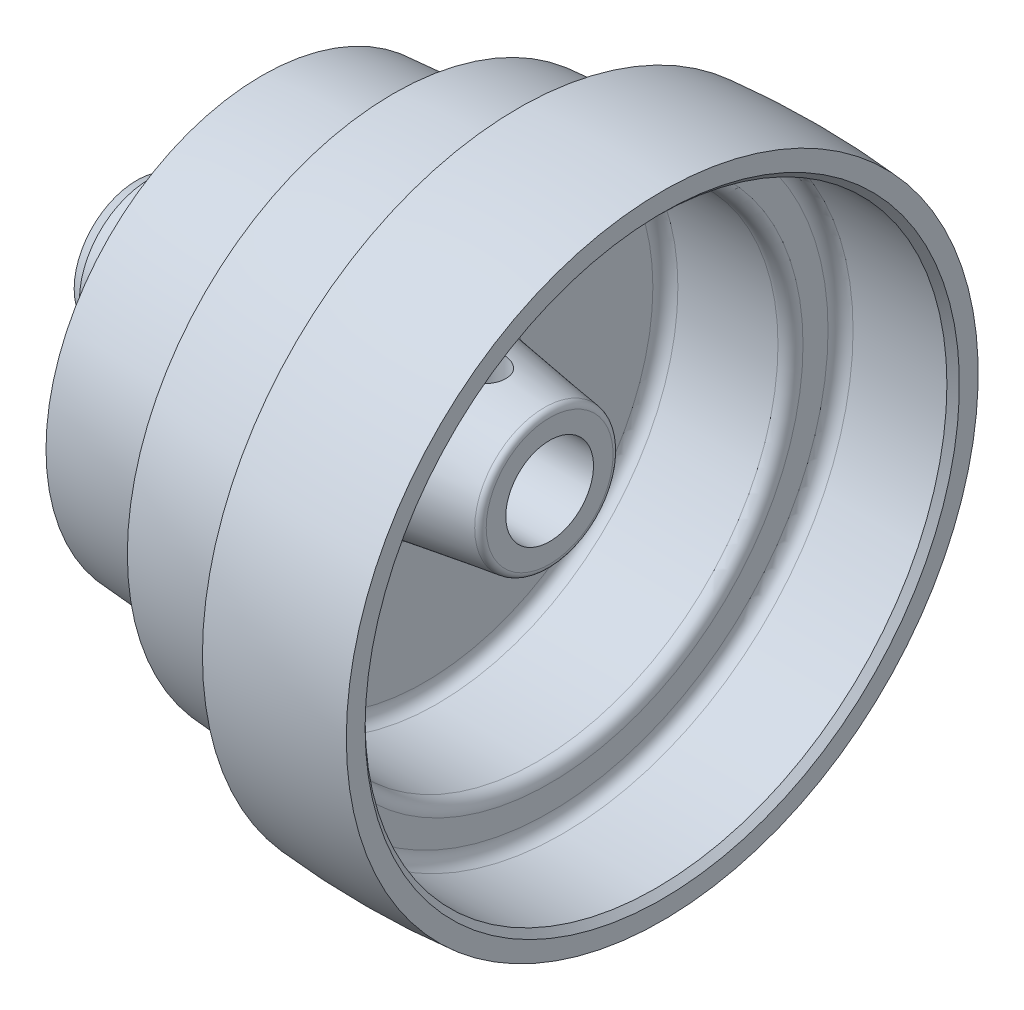
ISO-10303-21;
HEADER;
FILE_DESCRIPTION(('STEP AP214'),'2;1');
FILE_NAME('part.step','',(''),(''),'','','');
FILE_SCHEMA(('AUTOMOTIVE_DESIGN { 1 0 10303 214 1 1 1 1 }'));
ENDSEC;
DATA;
#1=APPLICATION_CONTEXT('core data for automotive mechanical design processes');
#2=APPLICATION_PROTOCOL_DEFINITION('international standard','automotive_design',2000,#1);
#3=PRODUCT_CONTEXT('',#1,'mechanical');
#4=PRODUCT('Part','Part','',(#3));
#5=PRODUCT_RELATED_PRODUCT_CATEGORY('part','',(#4));
#6=PRODUCT_DEFINITION_FORMATION('','',#4);
#7=PRODUCT_DEFINITION_CONTEXT('part definition',#1,'design');
#8=PRODUCT_DEFINITION('design','',#6,#7);
#9=PRODUCT_DEFINITION_SHAPE('','',#8);
#10=(LENGTH_UNIT() NAMED_UNIT(*) SI_UNIT(.MILLI.,.METRE.));
#11=(NAMED_UNIT(*) PLANE_ANGLE_UNIT() SI_UNIT($,.RADIAN.));
#12=(NAMED_UNIT(*) SI_UNIT($,.STERADIAN.) SOLID_ANGLE_UNIT());
#13=UNCERTAINTY_MEASURE_WITH_UNIT(LENGTH_MEASURE(1.E-05),#10,'distance_accuracy_value','');
#14=(GEOMETRIC_REPRESENTATION_CONTEXT(3) GLOBAL_UNCERTAINTY_ASSIGNED_CONTEXT((#13)) GLOBAL_UNIT_ASSIGNED_CONTEXT((#10,
#11,#12)) REPRESENTATION_CONTEXT('',''));
#15=CARTESIAN_POINT('',(0.,0.,0.));
#16=DIRECTION('',(0.,0.,1.));
#17=DIRECTION('',(1.,0.,0.));
#18=AXIS2_PLACEMENT_3D('',#15,#16,#17);
#19=CARTESIAN_POINT('',(0.,0.,0.));
#20=DIRECTION('',(-1.,0.,0.));
#21=DIRECTION('',(0.,0.,1.));
#22=AXIS2_PLACEMENT_3D('',#19,#20,#21);
#23=CYLINDRICAL_SURFACE('',#22,11.1252);
#24=CARTESIAN_POINT('',(104.775,0.,0.));
#25=DIRECTION('',(-1.,0.,0.));
#26=DIRECTION('',(0.,0.,1.));
#27=AXIS2_PLACEMENT_3D('',#24,#25,#26);
#28=CIRCLE('',#27,11.1252);
#29=CARTESIAN_POINT('',(104.775,0.,11.1252));
#30=VERTEX_POINT('',#29);
#31=EDGE_CURVE('E42',#30,#30,#28,.T.);
#32=ORIENTED_EDGE('',*,*,#31,.F.);
#33=EDGE_LOOP('',(#32));
#34=FACE_BOUND('',#33,.T.);
#35=CARTESIAN_POINT('',(0.,0.,0.));
#36=DIRECTION('',(-1.,0.,0.));
#37=DIRECTION('',(0.,0.,1.));
#38=AXIS2_PLACEMENT_3D('',#35,#36,#37);
#39=CIRCLE('',#38,11.1252);
#40=CARTESIAN_POINT('',(0.,0.,11.1252));
#41=VERTEX_POINT('',#40);
#42=EDGE_CURVE('E38',#41,#41,#39,.T.);
#43=ORIENTED_EDGE('',*,*,#42,.T.);
#44=EDGE_LOOP('',(#43));
#45=FACE_BOUND('',#44,.T.);
#46=CARTESIAN_POINT('',(88.9,10.0542860905188,-4.7625));
#47=CARTESIAN_POINT('',(88.7733011944272,10.0542871124357,-4.76249904606793));
#48=CARTESIAN_POINT('',(88.6465615300433,10.0566892733402,-4.75743676446919));
#49=CARTESIAN_POINT('',(88.3940105295757,10.0662182189194,-4.7372403874833));
#50=CARTESIAN_POINT('',(88.2681998283874,10.0733479780491,-4.72209995121747));
#51=CARTESIAN_POINT('',(88.0182481900197,10.092105518024,-4.68187715720568));
#52=CARTESIAN_POINT('',(87.8941112442076,10.1037425707971,-4.65677430318766));
#53=CARTESIAN_POINT('',(87.6486111749218,10.1311277582626,-4.59689107489739));
#54=CARTESIAN_POINT('',(87.5272492461105,10.146877628612,-4.56210661446522));
#55=CARTESIAN_POINT('',(87.2886948832533,10.1819015839587,-4.48339148983284));
#56=CARTESIAN_POINT('',(87.1714855660387,10.2011587967067,-4.43950447934892));
#57=CARTESIAN_POINT('',(86.9413105061965,10.2426702954767,-4.34287288732901));
#58=CARTESIAN_POINT('',(86.8283463835197,10.2649257110436,-4.29012496566914));
#59=CARTESIAN_POINT('',(86.496903826267,10.3352326746661,-4.11924844708133));
#60=CARTESIAN_POINT('',(86.2855844329065,10.386870103442,-3.98839031697297));
#61=CARTESIAN_POINT('',(85.8746855741986,10.4975997532583,-3.68750068601825));
#62=CARTESIAN_POINT('',(85.6765587151163,10.5569529350404,-3.51559783554345));
#63=CARTESIAN_POINT('',(85.3107659592518,10.6743263538246,-3.14120919298355));
#64=CARTESIAN_POINT('',(85.1431121935144,10.7323460519858,-2.93871127978598));
#65=CARTESIAN_POINT('',(84.914363081936,10.8152032797137,-2.61056620569943));
#66=CARTESIAN_POINT('',(84.8405466937211,10.8426836459681,-2.49425081074264));
#67=CARTESIAN_POINT('',(84.7030483773688,10.8949081597976,-2.25521259813972));
#68=CARTESIAN_POINT('',(84.6393622207912,10.9196534476934,-2.13249248243429));
#69=CARTESIAN_POINT('',(84.5226968780887,10.9657000605778,-1.88143352512228));
#70=CARTESIAN_POINT('',(84.4697185691238,10.987001103394,-1.75309422425296));
#71=CARTESIAN_POINT('',(84.3750396700995,11.0255187468169,-1.49178944345422));
#72=CARTESIAN_POINT('',(84.3333333666217,11.0427374161027,-1.35882634589975));
#73=CARTESIAN_POINT('',(84.263586321592,11.0717682114978,-1.09657475667202));
#74=CARTESIAN_POINT('',(84.2349278387432,11.0838226297055,-0.967477213218868));
#75=CARTESIAN_POINT('',(84.1884245020425,11.1034754592065,-0.707068600058978));
#76=CARTESIAN_POINT('',(84.1705747746665,11.1110758786985,-0.575758555430948));
#77=CARTESIAN_POINT('',(84.1458808575754,11.1216092704234,-0.31194140844064));
#78=CARTESIAN_POINT('',(84.1390349512154,11.1245429706843,-0.179434496039181));
#79=CARTESIAN_POINT('',(84.1364262180907,11.1256596148531,0.0857058304623865));
#80=CARTESIAN_POINT('',(84.1406629329732,11.1238427552336,0.218339239104103));
#81=CARTESIAN_POINT('',(84.1595369162449,11.1157812836451,0.474116293336629));
#82=CARTESIAN_POINT('',(84.1734863137652,11.1098295687584,0.59732065124539));
#83=CARTESIAN_POINT('',(84.2108981291852,11.0939649600712,0.842057229827164));
#84=CARTESIAN_POINT('',(84.2343636835211,11.0840507602884,0.963588885525408));
#85=CARTESIAN_POINT('',(84.2905711514195,11.0605085936871,1.20408064426644));
#86=CARTESIAN_POINT('',(84.3233099828025,11.0468818608688,1.32304158762656));
#87=CARTESIAN_POINT('',(84.3977581239846,11.0162475520204,1.55769107897314));
#88=CARTESIAN_POINT('',(84.4394708600122,10.999238684883,1.67337835793489));
#89=CARTESIAN_POINT('',(84.5789398900386,10.9431636586233,2.01784622018262));
#90=CARTESIAN_POINT('',(84.6902120365866,10.899404068443,2.24056489342837));
#91=CARTESIAN_POINT('',(84.9449473071363,10.8035749469121,2.66463664704096));
#92=CARTESIAN_POINT('',(85.0884219891525,10.7515024338602,2.86598201786777));
#93=CARTESIAN_POINT('',(85.415791171553,10.6396886903051,3.25753400792818));
#94=CARTESIAN_POINT('',(85.6018875515517,10.5796651185754,3.44582128529966));
#95=CARTESIAN_POINT('',(86.0032129341644,10.4615196222468,3.78942888044678));
#96=CARTESIAN_POINT('',(86.2184543908482,10.4033985238557,3.94473503169362));
#97=CARTESIAN_POINT('',(86.5635302122125,10.3215606685145,4.15226128656019));
#98=CARTESIAN_POINT('',(86.6846198121684,10.2947471704694,4.21812367207779));
#99=CARTESIAN_POINT('',(86.932566702441,10.2442548451093,4.33931147921758));
#100=CARTESIAN_POINT('',(87.0594214367917,10.2205746465165,4.39464151496808));
#101=CARTESIAN_POINT('',(87.3180394468522,10.1771813369919,4.49421954793816));
#102=CARTESIAN_POINT('',(87.4498019062756,10.1574675697972,4.53846937872143));
#103=CARTESIAN_POINT('',(87.7172089682754,10.1227520268162,4.61538190246624));
#104=CARTESIAN_POINT('',(87.8528514401057,10.1077477170038,4.6480508280149));
#105=CARTESIAN_POINT('',(88.1177644025693,10.083865356685,4.69962619000145));
#106=CARTESIAN_POINT('',(88.2468533911373,10.0746443666071,4.71930768512324));
#107=CARTESIAN_POINT('',(88.5064144737888,10.0611526953942,4.74800327646444));
#108=CARTESIAN_POINT('',(88.6368859038543,10.0568797375078,4.75702227888516));
#109=CARTESIAN_POINT('',(88.8981799588903,10.0534376457865,4.76429248868352));
#110=CARTESIAN_POINT('',(89.0290025394731,10.0542678946787,4.76254499835299));
#111=CARTESIAN_POINT('',(89.2899252251091,10.0609989737858,4.74830874750448));
#112=CARTESIAN_POINT('',(89.4200253542256,10.0668996340832,4.73582034693153));
#113=CARTESIAN_POINT('',(89.6694639116244,10.0829732502276,4.70149521730802));
#114=CARTESIAN_POINT('',(89.788921618258,10.0928206104682,4.68036888789915));
#115=CARTESIAN_POINT('',(90.0255269294353,10.1164019894749,4.62917578742));
#116=CARTESIAN_POINT('',(90.1426737674504,10.1301372754473,4.59910610124551));
#117=CARTESIAN_POINT('',(90.4894877196674,10.1765830590795,4.49588777322844));
#118=CARTESIAN_POINT('',(90.7147151233268,10.2145465047517,4.40970371633427));
#119=CARTESIAN_POINT('',(91.1573871959536,10.3021927802734,4.20097127990665));
#120=CARTESIAN_POINT('',(91.37406890255,10.352313021444,4.07700600504536));
#121=CARTESIAN_POINT('',(91.7846464306102,10.4580330868509,3.79762382925544));
#122=CARTESIAN_POINT('',(91.9785319547848,10.513635366694,3.64219280052125));
#123=CARTESIAN_POINT('',(92.3556060684825,10.6299074796838,3.28825523824915));
#124=CARTESIAN_POINT('',(92.5364036772393,10.690598079056,3.08718018666745));
#125=CARTESIAN_POINT('',(92.7805873498678,10.7769124410572,2.76418960936973));
#126=CARTESIAN_POINT('',(92.8575186338027,10.8049126818908,2.65288830535537));
#127=CARTESIAN_POINT('',(93.0018426348636,10.8586045584363,2.42375635078017));
#128=CARTESIAN_POINT('',(93.0692394671306,10.8842971883716,2.30592854785033));
#129=CARTESIAN_POINT('',(93.1942696333199,10.9327984328841,2.0638127834064));
#130=CARTESIAN_POINT('',(93.2518489442689,10.9555909250152,1.93949370242537));
#131=CARTESIAN_POINT('',(93.3562378829832,10.9974742076132,1.68586579025575));
#132=CARTESIAN_POINT('',(93.4030521779082,11.0165666016867,1.55655914991943));
#133=CARTESIAN_POINT('',(93.4854288010764,11.0504939569064,1.29390370754504));
#134=CARTESIAN_POINT('',(93.5209944529103,11.0653301754868,1.16055611225579));
#135=CARTESIAN_POINT('',(93.5804747116179,11.0903012481279,0.890857152312087));
#136=CARTESIAN_POINT('',(93.6043902535412,11.1004364794914,0.754506029642227));
#137=CARTESIAN_POINT('',(93.6389591659423,11.1151328719522,0.490033729509756));
#138=CARTESIAN_POINT('',(93.6504561136932,11.1200481383458,0.362041843233811));
#139=CARTESIAN_POINT('',(93.6630666991623,11.1254411003753,0.105407287620599));
#140=CARTESIAN_POINT('',(93.6641768533696,11.1259173072444,-0.0232355855723579));
#141=CARTESIAN_POINT('',(93.655993271069,11.1224155372254,-0.280056033994395));
#142=CARTESIAN_POINT('',(93.6467053184337,11.1184400365675,-0.408233828150242));
#143=CARTESIAN_POINT('',(93.6178351527283,11.1061454824221,-0.663259836497115));
#144=CARTESIAN_POINT('',(93.5982491106777,11.097824813345,-0.790107538235698));
#145=CARTESIAN_POINT('',(93.549962412146,11.0774707456896,-1.03652657400086));
#146=CARTESIAN_POINT('',(93.5216516954966,11.0655967172419,-1.15618757641564));
#147=CARTESIAN_POINT('',(93.4559979597088,11.0383379632927,-1.39261053661922));
#148=CARTESIAN_POINT('',(93.4186517975361,11.0229520162547,-1.50937146998301));
#149=CARTESIAN_POINT('',(93.2935422255474,10.9720553044049,-1.85414501985403));
#150=CARTESIAN_POINT('',(93.192667586191,10.9317880588897,-2.07685078235199));
#151=CARTESIAN_POINT('',(92.9538168804964,10.8401768983227,-2.51247952321556));
#152=CARTESIAN_POINT('',(92.8143584106138,10.7884115288294,-2.72449296178642));
#153=CARTESIAN_POINT('',(92.5044145003978,10.6798585747108,-3.12304318242194));
#154=CARTESIAN_POINT('',(92.3339168133265,10.6230690123178,-3.30956985747457));
#155=CARTESIAN_POINT('',(91.9520409620967,10.5056360802793,-3.66597996397418));
#156=CARTESIAN_POINT('',(91.7385960853953,10.4450115542827,-3.83367887850957));
#157=CARTESIAN_POINT('',(91.3985665000695,10.359508445969,-4.05672747426764));
#158=CARTESIAN_POINT('',(91.2818027749361,10.3318913886166,-4.12637515129083));
#159=CARTESIAN_POINT('',(91.0422964263165,10.2793227611068,-4.25563841602233));
#160=CARTESIAN_POINT('',(90.9195565552353,10.2543699804715,-4.31525856674421));
#161=CARTESIAN_POINT('',(90.6690283046209,10.2079869310035,-4.42386322990359));
#162=CARTESIAN_POINT('',(90.5412471937505,10.1865518050638,-4.47286243805557));
#163=CARTESIAN_POINT('',(90.2814124471522,10.1479299060066,-4.55980902207308));
#164=CARTESIAN_POINT('',(90.1493609612124,10.1307410317678,-4.59776186554103));
#165=CARTESIAN_POINT('',(89.8823101798627,10.1012888002637,-4.66211227138046));
#166=CARTESIAN_POINT('',(89.7473196495686,10.0890124765201,-4.68854026990793));
#167=CARTESIAN_POINT('',(89.4752535163388,10.0698165952235,-4.72962890558433));
#168=CARTESIAN_POINT('',(89.3381795946269,10.0628929302921,-4.74429856584709));
#169=CARTESIAN_POINT('',(89.1506593412533,10.0572852688619,-4.75616386625424));
#170=CARTESIAN_POINT('',(89.1005662125225,10.0561614541608,-4.75853913053353));
#171=CARTESIAN_POINT('',(89.0003175246951,10.0546616568238,-4.76170739866263));
#172=CARTESIAN_POINT('',(88.950161964631,10.0542856859265,-4.76250037767606));
#173=CARTESIAN_POINT('',(88.9,10.0542860905188,-4.7625));
#174=B_SPLINE_CURVE_WITH_KNOTS('',3,(#46,#47,#48,#49,#50,#51,#52,#53,#54,#55,#56,#57,#58,#59,
#60,#61,#62,#63,#64,#65,#66,#67,#68,#69,#70,#71,#72,#73,#74,#75,#76,#77,#78,#79,#80,#81,#82,#83,
#84,#85,#86,#87,#88,#89,#90,#91,#92,#93,#94,#95,#96,#97,#98,#99,#100,#101,#102,#103,#104,#105,
#106,#107,#108,#109,#110,#111,#112,#113,#114,#115,#116,#117,#118,#119,#120,#121,#122,#123,#124,
#125,#126,#127,#128,#129,#130,#131,#132,#133,#134,#135,#136,#137,#138,#139,#140,#141,#142,#143,
#144,#145,#146,#147,#148,#149,#150,#151,#152,#153,#154,#155,#156,#157,#158,#159,#160,#161,#162,
#163,#164,#165,#166,#167,#168,#169,#170,#171,#172,#173),.UNSPECIFIED.,.T.,.F.,(4,2,2,2,2,2,2,2,
2,2,2,2,2,2,2,2,2,2,2,2,2,2,2,2,2,2,2,2,2,2,2,2,2,2,2,2,2,2,2,2,2,2,2,2,2,2,2,2,2,2,2,2,2,2,2,2,
2,2,2,2,2,2,2,4),(0.,0.380044260645813,0.760327860265619,1.14139792980455,1.52262907597954,
1.90207253390259,2.28165934546398,3.0399142753818,3.84340771513948,4.64722032066946,
5.06819942206477,5.48900233965595,5.90983971440898,6.33046337842716,6.72830828115027,
7.1259736670672,7.52357700939471,7.92116390797946,8.29312790295517,8.66521459355142,
9.03717775770602,9.40928318989154,10.1641078573299,10.9192038781049,11.7300386718076,
12.5412210456439,12.9620440871077,13.3826823433143,13.8032509458006,14.2235928627089,
14.6157887669524,15.0078041372476,15.3997720911365,15.7917269100653,16.1564278312188,
16.5212477578559,17.2503269961402,18.0110739362844,18.7721632047065,19.5993443028828,
20.0134427271099,20.4273618744582,20.8434899298349,21.2594372318076,21.6752615204659,
22.0910524291446,22.4763677529506,22.8618122987358,23.2470425502206,23.6324161373513,
24.0025908402447,24.3728944962531,25.1128878654124,25.8866337685931,26.6606856228408,
27.4908110629415,27.9065972056532,28.3221936304642,28.7372112898172,29.1520231778007,
29.565732848199,29.9791247413025,30.1295876240967,30.2800528686152),.UNSPECIFIED.);
#175=CARTESIAN_POINT('',(88.9,10.0542860905188,-4.7625));
#176=VERTEX_POINT('',#175);
#177=EDGE_CURVE('E123',#176,#176,#174,.T.);
#178=ORIENTED_EDGE('',*,*,#177,.T.);
#179=EDGE_LOOP('',(#178));
#180=FACE_BOUND('',#179,.T.);
#181=ADVANCED_FACE('F31',(#34,#45,#180),#23,.F.);
#182=CARTESIAN_POINT('',(103.422990469027,0.,0.));
#183=DIRECTION('',(-1.,0.,0.));
#184=DIRECTION('',(0.,0.,1.));
#185=AXIS2_PLACEMENT_3D('',#182,#183,#184);
#186=CONICAL_SURFACE('',#185,17.665301429646,0.148889947609497);
#187=CARTESIAN_POINT('',(75.7290190619465,0.,0.));
#188=DIRECTION('',(-1.,0.,0.));
#189=DIRECTION('',(0.,0.,1.));
#190=AXIS2_PLACEMENT_3D('',#187,#188,#189);
#191=CIRCLE('',#190,21.819397140708);
#192=CARTESIAN_POINT('',(75.7290190619465,0.,21.819397140708));
#193=VERTEX_POINT('',#192);
#194=EDGE_CURVE('E54',#193,#193,#191,.T.);
#195=ORIENTED_EDGE('',*,*,#194,.F.);
#196=EDGE_LOOP('',(#195));
#197=FACE_BOUND('',#196,.T.);
#198=CARTESIAN_POINT('',(103.422990469027,0.,0.));
#199=DIRECTION('',(-1.,0.,0.));
#200=DIRECTION('',(0.,0.,1.));
#201=AXIS2_PLACEMENT_3D('',#198,#199,#200);
#202=CIRCLE('',#201,17.665301429646);
#203=CARTESIAN_POINT('',(103.422990469027,0.,17.665301429646));
#204=VERTEX_POINT('',#203);
#205=EDGE_CURVE('E51',#204,#204,#202,.T.);
#206=ORIENTED_EDGE('',*,*,#205,.T.);
#207=EDGE_LOOP('',(#206));
#208=FACE_BOUND('',#207,.T.);
#209=CARTESIAN_POINT('',(84.9192220277342,20.2729923368184,-2.61434752587749));
#210=CARTESIAN_POINT('',(85.0698941329425,20.2206182582488,-2.84374625596204));
#211=CARTESIAN_POINT('',(85.2399786841323,20.16300333077,-3.05941286223351));
#212=CARTESIAN_POINT('',(85.6136354470536,20.0416654400586,-3.45774516869795));
#213=CARTESIAN_POINT('',(85.8172516270085,19.9779345036346,-3.64036687006982));
#214=CARTESIAN_POINT('',(86.2520468438234,19.8489792263767,-3.96783168155459));
#215=CARTESIAN_POINT('',(86.483190142424,19.7837569088442,-4.11272301405075));
#216=CARTESIAN_POINT('',(86.9673320313662,19.6560911258158,-4.36121748871792));
#217=CARTESIAN_POINT('',(87.2203244467682,19.593646882698,-4.46483225020236));
#218=CARTESIAN_POINT('',(87.7440035186898,19.4749620958665,-4.628274701094));
#219=CARTESIAN_POINT('',(88.0148224020521,19.4187788518901,-4.68772235879333));
#220=CARTESIAN_POINT('',(88.5645592600574,19.3165854856505,-4.75874342984222));
#221=CARTESIAN_POINT('',(88.8434754584237,19.2705731510286,-4.77032726416632));
#222=CARTESIAN_POINT('',(89.3905234998811,19.192359922279,-4.74478571118572));
#223=CARTESIAN_POINT('',(89.6586743400397,19.1597129209044,-4.70943786121756));
#224=CARTESIAN_POINT('',(90.1862249604963,19.1064686025959,-4.59346554933681));
#225=CARTESIAN_POINT('',(90.4456264926755,19.0858688597696,-4.5128502091115));
#226=CARTESIAN_POINT('',(90.9389549999716,19.0563829727695,-4.31191509603255));
#227=CARTESIAN_POINT('',(91.1734474164366,19.047123462433,-4.19303372235718));
#228=CARTESIAN_POINT('',(91.6198230801288,19.0371861891825,-3.91824698713316));
#229=CARTESIAN_POINT('',(91.8317057718619,19.0365086370689,-3.76234071623015));
#230=CARTESIAN_POINT('',(92.2274546913785,19.0411419646681,-3.41739019001189));
#231=CARTESIAN_POINT('',(92.4112413932529,19.0464694979966,-3.22825501310424));
#232=CARTESIAN_POINT('',(92.7451003600858,19.0602091284722,-2.82235330424429));
#233=CARTESIAN_POINT('',(92.8951698282531,19.0686214813479,-2.60558448246058));
#234=CARTESIAN_POINT('',(93.1596781092062,19.0858469594846,-2.14658643009896));
#235=CARTESIAN_POINT('',(93.2734995441231,19.0946643719774,-1.90400127602269));
#236=CARTESIAN_POINT('',(93.4589394362134,19.1100982404966,-1.4031362872795));
#237=CARTESIAN_POINT('',(93.530558002728,19.1167147022255,-1.14485649327688));
#238=CARTESIAN_POINT('',(93.6296429356124,19.1260859394508,-0.61930441224419));
#239=CARTESIAN_POINT('',(93.6570133828456,19.1288323239148,-0.352013868157056));
#240=CARTESIAN_POINT('',(93.6664935875596,19.1297699514166,0.183372281689342));
#241=CARTESIAN_POINT('',(93.6486042670514,19.1279612872476,0.451467870937471));
#242=CARTESIAN_POINT('',(93.5682705342762,19.1202431260631,0.979648914539141));
#243=CARTESIAN_POINT('',(93.5060177420387,19.114351268667,1.23976381739691));
#244=CARTESIAN_POINT('',(93.3389570896429,19.09994749104,1.74587770409531));
#245=CARTESIAN_POINT('',(93.2341471706171,19.0914354440518,1.99187600433278));
#246=CARTESIAN_POINT('',(92.9844746678843,19.0740680346219,2.46373082545977));
#247=CARTESIAN_POINT('',(92.8394724846138,19.0652115698059,2.68951344777111));
#248=CARTESIAN_POINT('',(92.5136102124396,19.0500846044537,3.11363800393215));
#249=CARTESIAN_POINT('',(92.3327497245323,19.0438141326949,3.31197963239776));
#250=CARTESIAN_POINT('',(91.9401960197216,19.0369589127481,3.6756235612897));
#251=CARTESIAN_POINT('',(91.7284947179794,19.0363756581812,3.84091717122514));
#252=CARTESIAN_POINT('',(91.2804627192517,19.0437584973267,4.13356634956891));
#253=CARTESIAN_POINT('',(91.0441356216881,19.0517233431868,4.2609274519004));
#254=CARTESIAN_POINT('',(90.5576971828229,19.0781283447181,4.47244008892432));
#255=CARTESIAN_POINT('',(90.3078491752779,19.0964078382808,4.55721750486342));
#256=CARTESIAN_POINT('',(89.7986426011533,19.1442768534696,4.68430405197272));
#257=CARTESIAN_POINT('',(89.5392846387212,19.1738656577604,4.72661587606471));
#258=CARTESIAN_POINT('',(89.020544467793,19.2437818925522,4.7680293537362));
#259=CARTESIAN_POINT('',(88.7611760390597,19.2840299969554,4.76744173585058));
#260=CARTESIAN_POINT('',(88.2475641733178,19.3738689023044,4.72463564276249));
#261=CARTESIAN_POINT('',(87.9933215154277,19.4234611118798,4.6824108866677));
#262=CARTESIAN_POINT('',(87.4893609114967,19.5310422160645,4.55640476832519));
#263=CARTESIAN_POINT('',(87.2399664254813,19.5892265690214,4.47149827965609));
#264=CARTESIAN_POINT('',(86.7593087515217,19.7095640518209,4.26235057777355));
#265=CARTESIAN_POINT('',(86.528050415466,19.7717182356813,4.13809888318593));
#266=CARTESIAN_POINT('',(86.0798483004798,19.8988612691178,3.8473765041497));
#267=CARTESIAN_POINT('',(85.8638933547319,19.963860954916,3.67937106579517));
#268=CARTESIAN_POINT('',(85.5635359483093,20.0581289793409,3.40119466603616));
#269=CARTESIAN_POINT('',(85.4672950877701,20.0890307221995,3.30404135231993));
#270=CARTESIAN_POINT('',(85.28330943526,20.1492096369375,3.10155373581984));
#271=CARTESIAN_POINT('',(85.1955611797308,20.1784874690028,2.99622279998898));
#272=CARTESIAN_POINT('',(85.0290169017391,20.2349400461218,2.77773666664063));
#273=CARTESIAN_POINT('',(84.9502444936657,20.2621091862545,2.66456203511024));
#274=CARTESIAN_POINT('',(84.8025966119292,20.3137125595781,2.43140291133063));
#275=CARTESIAN_POINT('',(84.7337168793868,20.3381479686555,2.31142138073022));
#276=CARTESIAN_POINT('',(84.6064397857733,20.3837907328072,2.06541260652255));
#277=CARTESIAN_POINT('',(84.5480435762424,20.4049977332249,1.93938470068847));
#278=CARTESIAN_POINT('',(84.4423472099542,20.4437092570882,1.68227382921383));
#279=CARTESIAN_POINT('',(84.3950417378396,20.4612155537393,1.55119332030771));
#280=CARTESIAN_POINT('',(84.314125200057,20.4913481896695,1.29176817106083));
#281=CARTESIAN_POINT('',(84.2799370041388,20.5041784858611,1.16362705594399));
#282=CARTESIAN_POINT('',(84.2223337981602,20.5258832071294,0.90467098141054));
#283=CARTESIAN_POINT('',(84.1989140566884,20.534759369508,0.773857222730323));
#284=CARTESIAN_POINT('',(84.1630763167823,20.5483706190922,0.510510049531518));
#285=CARTESIAN_POINT('',(84.1506588881647,20.5531054918176,0.377976546306939));
#286=CARTESIAN_POINT('',(84.1369650411337,20.5583281558773,0.112254511144927));
#287=CARTESIAN_POINT('',(84.1356881432366,20.5588161299962,-0.0209339923547027));
#288=CARTESIAN_POINT('',(84.1440652899893,20.555619910925,-0.28002653445924));
#289=CARTESIAN_POINT('',(84.1531585844293,20.5521497455867,-0.405951761219687));
#290=CARTESIAN_POINT('',(84.1812897493854,20.541448894087,-0.656571959635656));
#291=CARTESIAN_POINT('',(84.2003313245765,20.5342168070147,-0.781266455337424));
#292=CARTESIAN_POINT('',(84.2481537708103,20.5161422694977,-1.02837273887805));
#293=CARTESIAN_POINT('',(84.2769244457521,20.5053035989434,-1.15078677551038));
#294=CARTESIAN_POINT('',(84.3439373782576,20.4802242836051,-1.39264542366555));
#295=CARTESIAN_POINT('',(84.3821816596526,20.4659829119306,-1.51208939469067));
#296=CARTESIAN_POINT('',(84.4882890782994,20.4267966352796,-1.80343120893355));
#297=CARTESIAN_POINT('',(84.5615750821372,20.3999879996144,-1.97314000263246));
#298=CARTESIAN_POINT('',(84.7267657286626,20.3405618658325,-2.30205389382971));
#299=CARTESIAN_POINT('',(84.8186711679153,20.3079441192012,-2.46125854155968));
#300=CARTESIAN_POINT('',(84.9192220277342,20.2729923368184,-2.61434752587749));
#301=B_SPLINE_CURVE_WITH_KNOTS('',3,(#209,#210,#211,#212,#213,#214,#215,#216,#217,#218,#219,
#220,#221,#222,#223,#224,#225,#226,#227,#228,#229,#230,#231,#232,#233,#234,#235,#236,#237,#238,
#239,#240,#241,#242,#243,#244,#245,#246,#247,#248,#249,#250,#251,#252,#253,#254,#255,#256,#257,
#258,#259,#260,#261,#262,#263,#264,#265,#266,#267,#268,#269,#270,#271,#272,#273,#274,#275,#276,
#277,#278,#279,#280,#281,#282,#283,#284,#285,#286,#287,#288,#289,#290,#291,#292,#293,#294,#295,
#296,#297,#298,#299,#300),.UNSPECIFIED.,.T.,.F.,(4,2,2,2,2,2,2,2,2,2,2,2,2,2,2,2,2,2,2,2,2,2,2,
2,2,2,2,2,2,2,2,2,2,2,2,2,2,2,2,2,2,2,2,2,2,4),(0.,0.837551499853176,1.67621011071585,
2.5137915298327,3.35113700372634,4.19560644808839,5.03989202376204,5.8530950949707,
6.66613435936065,7.4516156433803,8.23711622130118,9.02480056145931,9.812550214688,
10.6130765273932,11.4136007660498,12.2158580304109,13.0180989516908,13.8168955777444,
14.6157308533153,15.4173762576767,16.2190305826361,17.0208954386124,17.8226432542227,
18.6122346363524,19.4017759440073,20.1855990304148,20.9695403733084,21.7753249889289,
22.5813244425486,23.4206884913668,23.8408774264448,24.2608942663639,24.6819917815238,
25.1029074637647,25.5238693523411,25.9446290760124,26.3438466103381,26.7428885696392,
27.1419511943608,27.5409966435126,27.9194471574933,28.2980387045455,28.6762347108171,
29.0545115802791,29.6134267147675,30.1723657654724),.UNSPECIFIED.);
#302=CARTESIAN_POINT('',(84.9192220277342,20.2729923368184,-2.61434752587749));
#303=VERTEX_POINT('',#302);
#304=EDGE_CURVE('E124',#303,#303,#301,.T.);
#305=ORIENTED_EDGE('',*,*,#304,.T.);
#306=EDGE_LOOP('',(#305));
#307=FACE_BOUND('',#306,.T.);
#308=ADVANCED_FACE('F231',(#197,#208,#307),#186,.T.);
#309=CARTESIAN_POINT('',(3.16014561425619,0.,0.));
#310=DIRECTION('',(1.,0.,0.));
#311=DIRECTION('',(0.,0.,-1.));
#312=AXIS2_PLACEMENT_3D('',#309,#310,#311);
#313=CONICAL_SURFACE('',#312,17.6995109210692,0.523598775598297);
#314=CARTESIAN_POINT('',(0.,0.,0.));
#315=DIRECTION('',(-1.,0.,0.));
#316=DIRECTION('',(0.,0.,1.));
#317=AXIS2_PLACEMENT_3D('',#314,#315,#316);
#318=CIRCLE('',#317,15.875);
#319=CARTESIAN_POINT('',(0.,0.,15.875));
#320=VERTEX_POINT('',#319);
#321=EDGE_CURVE('E10',#320,#320,#318,.T.);
#322=ORIENTED_EDGE('',*,*,#321,.F.);
#323=EDGE_LOOP('',(#322));
#324=FACE_BOUND('',#323,.T.);
#325=CARTESIAN_POINT('',(3.16014561425619,0.,0.));
#326=DIRECTION('',(-1.,0.,0.));
#327=DIRECTION('',(0.,0.,1.));
#328=AXIS2_PLACEMENT_3D('',#325,#326,#327);
#329=CIRCLE('',#328,17.6995109210692);
#330=CARTESIAN_POINT('',(3.16014561425619,0.,17.6995109210692));
#331=VERTEX_POINT('',#330);
#332=EDGE_CURVE('E120',#331,#331,#329,.T.);
#333=ORIENTED_EDGE('',*,*,#332,.T.);
#334=EDGE_LOOP('',(#333));
#335=FACE_BOUND('',#334,.T.);
#336=ADVANCED_FACE('F33',(#324,#335),#313,.T.);
#337=CARTESIAN_POINT('',(0.,11.1252,0.));
#338=DIRECTION('',(1.,0.,0.));
#339=DIRECTION('',(0.,0.,-1.));
#340=AXIS2_PLACEMENT_3D('',#337,#338,#339);
#341=PLANE('',#340);
#342=ORIENTED_EDGE('',*,*,#42,.F.);
#343=EDGE_LOOP('',(#342));
#344=FACE_BOUND('',#343,.T.);
#345=ORIENTED_EDGE('',*,*,#321,.T.);
#346=EDGE_LOOP('',(#345));
#347=FACE_BOUND('',#346,.T.);
#348=ADVANCED_FACE('F241',(#344,#347),#341,.F.);
#349=CARTESIAN_POINT('',(104.775,16.0953649694676,0.));
#350=DIRECTION('',(-1.,0.,0.));
#351=DIRECTION('',(0.,0.,1.));
#352=AXIS2_PLACEMENT_3D('',#349,#350,#351);
#353=PLANE('',#352);
#354=CARTESIAN_POINT('',(104.775,0.,0.));
#355=DIRECTION('',(-1.,0.,0.));
#356=DIRECTION('',(0.,0.,1.));
#357=AXIS2_PLACEMENT_3D('',#354,#355,#356);
#358=CIRCLE('',#357,16.0953649694676);
#359=CARTESIAN_POINT('',(104.775,0.,16.0953649694676));
#360=VERTEX_POINT('',#359);
#361=EDGE_CURVE('E46',#360,#360,#358,.T.);
#362=ORIENTED_EDGE('',*,*,#361,.F.);
#363=EDGE_LOOP('',(#362));
#364=FACE_BOUND('',#363,.T.);
#365=ORIENTED_EDGE('',*,*,#31,.T.);
#366=EDGE_LOOP('',(#365));
#367=FACE_BOUND('',#366,.T.);
#368=ADVANCED_FACE('F237',(#364,#367),#353,.F.);
#369=CARTESIAN_POINT('',(103.1875,0.,0.));
#370=DIRECTION('',(-1.,0.,0.));
#371=DIRECTION('',(0.,0.,1.));
#372=AXIS2_PLACEMENT_3D('',#369,#370,#371);
#373=TOROIDAL_SURFACE('',#372,16.0953649694676,1.58750000000001);
#374=ORIENTED_EDGE('',*,*,#205,.F.);
#375=EDGE_LOOP('',(#374));
#376=FACE_BOUND('',#375,.T.);
#377=ORIENTED_EDGE('',*,*,#361,.T.);
#378=EDGE_LOOP('',(#377));
#379=FACE_BOUND('',#378,.T.);
#380=ADVANCED_FACE('F229',(#376,#379),#373,.T.);
#381=CARTESIAN_POINT('',(76.2,0.,0.));
#382=DIRECTION('',(-1.,0.,0.));
#383=DIRECTION('',(0.,0.,1.));
#384=AXIS2_PLACEMENT_3D('',#381,#382,#383);
#385=TOROIDAL_SURFACE('',#384,24.9592700610649,3.175);
#386=CARTESIAN_POINT('',(73.025,0.,0.));
#387=DIRECTION('',(-1.,0.,0.));
#388=DIRECTION('',(0.,0.,1.));
#389=AXIS2_PLACEMENT_3D('',#386,#387,#388);
#390=CIRCLE('',#389,24.9592700610649);
#391=CARTESIAN_POINT('',(73.025,0.,24.9592700610649));
#392=VERTEX_POINT('',#391);
#393=EDGE_CURVE('E57',#392,#392,#390,.T.);
#394=ORIENTED_EDGE('',*,*,#393,.F.);
#395=EDGE_LOOP('',(#394));
#396=FACE_BOUND('',#395,.T.);
#397=ORIENTED_EDGE('',*,*,#194,.T.);
#398=EDGE_LOOP('',(#397));
#399=FACE_BOUND('',#398,.T.);
#400=ADVANCED_FACE('F225',(#396,#399),#385,.F.);
#401=CARTESIAN_POINT('',(73.025,24.9592700610649,0.));
#402=DIRECTION('',(-1.,0.,0.));
#403=DIRECTION('',(0.,0.,1.));
#404=AXIS2_PLACEMENT_3D('',#401,#402,#403);
#405=PLANE('',#404);
#406=CARTESIAN_POINT('',(73.025,0.,0.));
#407=DIRECTION('',(-1.,0.,0.));
#408=DIRECTION('',(0.,0.,1.));
#409=AXIS2_PLACEMENT_3D('',#406,#407,#408);
#410=CIRCLE('',#409,57.94375);
#411=CARTESIAN_POINT('',(73.025,0.,57.94375));
#412=VERTEX_POINT('',#411);
#413=EDGE_CURVE('E60',#412,#412,#410,.T.);
#414=ORIENTED_EDGE('',*,*,#413,.F.);
#415=EDGE_LOOP('',(#414));
#416=FACE_BOUND('',#415,.T.);
#417=ORIENTED_EDGE('',*,*,#393,.T.);
#418=EDGE_LOOP('',(#417));
#419=FACE_BOUND('',#418,.T.);
#420=ADVANCED_FACE('F221',(#416,#419),#405,.F.);
#421=CARTESIAN_POINT('',(76.2,0.,0.));
#422=DIRECTION('',(-1.,0.,0.));
#423=DIRECTION('',(0.,0.,1.));
#424=AXIS2_PLACEMENT_3D('',#421,#422,#423);
#425=TOROIDAL_SURFACE('',#424,57.94375,3.175);
#426=CARTESIAN_POINT('',(76.2,0.,0.));
#427=DIRECTION('',(-1.,0.,0.));
#428=DIRECTION('',(0.,0.,1.));
#429=AXIS2_PLACEMENT_3D('',#426,#427,#428);
#430=CIRCLE('',#429,61.11875);
#431=CARTESIAN_POINT('',(76.2,0.,61.11875));
#432=VERTEX_POINT('',#431);
#433=EDGE_CURVE('E63',#432,#432,#430,.T.);
#434=ORIENTED_EDGE('',*,*,#433,.F.);
#435=EDGE_LOOP('',(#434));
#436=FACE_BOUND('',#435,.T.);
#437=ORIENTED_EDGE('',*,*,#413,.T.);
#438=EDGE_LOOP('',(#437));
#439=FACE_BOUND('',#438,.T.);
#440=ADVANCED_FACE('F217',(#436,#439),#425,.F.);
#441=CARTESIAN_POINT('',(0.,0.,0.));
#442=DIRECTION('',(-1.,0.,0.));
#443=DIRECTION('',(0.,0.,1.));
#444=AXIS2_PLACEMENT_3D('',#441,#442,#443);
#445=CYLINDRICAL_SURFACE('',#444,61.11875);
#446=CARTESIAN_POINT('',(101.6,0.,0.));
#447=DIRECTION('',(-1.,0.,0.));
#448=DIRECTION('',(0.,0.,1.));
#449=AXIS2_PLACEMENT_3D('',#446,#447,#448);
#450=CIRCLE('',#449,61.11875);
#451=CARTESIAN_POINT('',(101.6,0.,61.11875));
#452=VERTEX_POINT('',#451);
#453=EDGE_CURVE('E66',#452,#452,#450,.T.);
#454=ORIENTED_EDGE('',*,*,#453,.F.);
#455=EDGE_LOOP('',(#454));
#456=FACE_BOUND('',#455,.T.);
#457=ORIENTED_EDGE('',*,*,#433,.T.);
#458=EDGE_LOOP('',(#457));
#459=FACE_BOUND('',#458,.T.);
#460=ADVANCED_FACE('F213',(#456,#459),#445,.F.);
#461=CARTESIAN_POINT('',(101.6,0.,0.));
#462=DIRECTION('',(-1.,0.,0.));
#463=DIRECTION('',(0.,0.,1.));
#464=AXIS2_PLACEMENT_3D('',#461,#462,#463);
#465=TOROIDAL_SURFACE('',#464,64.29375,3.175);
#466=CARTESIAN_POINT('',(104.775,0.,0.));
#467=DIRECTION('',(-1.,0.,0.));
#468=DIRECTION('',(0.,0.,1.));
#469=AXIS2_PLACEMENT_3D('',#466,#467,#468);
#470=CIRCLE('',#469,64.29375);
#471=CARTESIAN_POINT('',(104.775,0.,64.29375));
#472=VERTEX_POINT('',#471);
#473=EDGE_CURVE('E69',#472,#472,#470,.T.);
#474=ORIENTED_EDGE('',*,*,#473,.F.);
#475=EDGE_LOOP('',(#474));
#476=FACE_BOUND('',#475,.T.);
#477=ORIENTED_EDGE('',*,*,#453,.T.);
#478=EDGE_LOOP('',(#477));
#479=FACE_BOUND('',#478,.T.);
#480=ADVANCED_FACE('F209',(#476,#479),#465,.T.);
#481=CARTESIAN_POINT('',(104.775,64.29375,0.));
#482=DIRECTION('',(-1.,0.,0.));
#483=DIRECTION('',(0.,0.,1.));
#484=AXIS2_PLACEMENT_3D('',#481,#482,#483);
#485=PLANE('',#484);
#486=CARTESIAN_POINT('',(104.775,0.,0.));
#487=DIRECTION('',(-1.,0.,0.));
#488=DIRECTION('',(0.,0.,1.));
#489=AXIS2_PLACEMENT_3D('',#486,#487,#488);
#490=CIRCLE('',#489,70.64375);
#491=CARTESIAN_POINT('',(104.775,0.,70.64375));
#492=VERTEX_POINT('',#491);
#493=EDGE_CURVE('E72',#492,#492,#490,.T.);
#494=ORIENTED_EDGE('',*,*,#493,.F.);
#495=EDGE_LOOP('',(#494));
#496=FACE_BOUND('',#495,.T.);
#497=ORIENTED_EDGE('',*,*,#473,.T.);
#498=EDGE_LOOP('',(#497));
#499=FACE_BOUND('',#498,.T.);
#500=ADVANCED_FACE('F205',(#496,#499),#485,.F.);
#501=CARTESIAN_POINT('',(107.95,0.,0.));
#502=DIRECTION('',(-1.,0.,0.));
#503=DIRECTION('',(0.,0.,1.));
#504=AXIS2_PLACEMENT_3D('',#501,#502,#503);
#505=TOROIDAL_SURFACE('',#504,70.64375,3.175);
#506=CARTESIAN_POINT('',(107.95,0.,0.));
#507=DIRECTION('',(-1.,0.,0.));
#508=DIRECTION('',(0.,0.,1.));
#509=AXIS2_PLACEMENT_3D('',#506,#507,#508);
#510=CIRCLE('',#509,73.81875);
#511=CARTESIAN_POINT('',(107.95,0.,73.81875));
#512=VERTEX_POINT('',#511);
#513=EDGE_CURVE('E75',#512,#512,#510,.T.);
#514=ORIENTED_EDGE('',*,*,#513,.F.);
#515=EDGE_LOOP('',(#514));
#516=FACE_BOUND('',#515,.T.);
#517=ORIENTED_EDGE('',*,*,#493,.T.);
#518=EDGE_LOOP('',(#517));
#519=FACE_BOUND('',#518,.T.);
#520=ADVANCED_FACE('F201',(#516,#519),#505,.F.);
#521=CARTESIAN_POINT('',(0.,0.,0.));
#522=DIRECTION('',(-1.,0.,0.));
#523=DIRECTION('',(0.,0.,1.));
#524=AXIS2_PLACEMENT_3D('',#521,#522,#523);
#525=CYLINDRICAL_SURFACE('',#524,73.81875);
#526=CARTESIAN_POINT('',(131.7625,0.,0.));
#527=DIRECTION('',(-1.,0.,0.));
#528=DIRECTION('',(0.,0.,1.));
#529=AXIS2_PLACEMENT_3D('',#526,#527,#528);
#530=CIRCLE('',#529,73.81875);
#531=CARTESIAN_POINT('',(131.7625,0.,73.81875));
#532=VERTEX_POINT('',#531);
#533=EDGE_CURVE('E78',#532,#532,#530,.T.);
#534=ORIENTED_EDGE('',*,*,#533,.F.);
#535=EDGE_LOOP('',(#534));
#536=FACE_BOUND('',#535,.T.);
#537=ORIENTED_EDGE('',*,*,#513,.T.);
#538=EDGE_LOOP('',(#537));
#539=FACE_BOUND('',#538,.T.);
#540=ADVANCED_FACE('F197',(#536,#539),#525,.F.);
#541=CARTESIAN_POINT('',(131.7625,0.,0.));
#542=DIRECTION('',(1.,0.,0.));
#543=DIRECTION('',(0.,0.,-1.));
#544=AXIS2_PLACEMENT_3D('',#541,#542,#543);
#545=CONICAL_SURFACE('',#544,73.81875,0.785398163397453);
#546=CARTESIAN_POINT('',(133.35,0.,0.));
#547=DIRECTION('',(-1.,0.,0.));
#548=DIRECTION('',(0.,0.,1.));
#549=AXIS2_PLACEMENT_3D('',#546,#547,#548);
#550=CIRCLE('',#549,75.40625);
#551=CARTESIAN_POINT('',(133.35,0.,75.40625));
#552=VERTEX_POINT('',#551);
#553=EDGE_CURVE('E81',#552,#552,#550,.T.);
#554=ORIENTED_EDGE('',*,*,#553,.F.);
#555=EDGE_LOOP('',(#554));
#556=FACE_BOUND('',#555,.T.);
#557=ORIENTED_EDGE('',*,*,#533,.T.);
#558=EDGE_LOOP('',(#557));
#559=FACE_BOUND('',#558,.T.);
#560=ADVANCED_FACE('F193',(#556,#559),#545,.F.);
#561=CARTESIAN_POINT('',(133.35,75.40625,0.));
#562=DIRECTION('',(-1.,0.,0.));
#563=DIRECTION('',(0.,0.,1.));
#564=AXIS2_PLACEMENT_3D('',#561,#562,#563);
#565=PLANE('',#564);
#566=CARTESIAN_POINT('',(133.35,0.,0.));
#567=DIRECTION('',(-1.,0.,0.));
#568=DIRECTION('',(0.,0.,1.));
#569=AXIS2_PLACEMENT_3D('',#566,#567,#568);
#570=CIRCLE('',#569,80.16875);
#571=CARTESIAN_POINT('',(133.35,0.,80.16875));
#572=VERTEX_POINT('',#571);
#573=EDGE_CURVE('E84',#572,#572,#570,.T.);
#574=ORIENTED_EDGE('',*,*,#573,.F.);
#575=EDGE_LOOP('',(#574));
#576=FACE_BOUND('',#575,.T.);
#577=ORIENTED_EDGE('',*,*,#553,.T.);
#578=EDGE_LOOP('',(#577));
#579=FACE_BOUND('',#578,.T.);
#580=ADVANCED_FACE('F189',(#576,#579),#565,.F.);
#581=CARTESIAN_POINT('',(115.09375,0.,0.));
#582=DIRECTION('',(-1.,0.,0.));
#583=DIRECTION('',(0.,0.,1.));
#584=AXIS2_PLACEMENT_3D('',#581,#582,#583);
#585=DEGENERATE_TOROIDAL_SURFACE('',#584,129.381250000001,210.343750000001,.F.);
#586=CARTESIAN_POINT('',(96.8375,0.,0.));
#587=DIRECTION('',(-1.,0.,0.));
#588=DIRECTION('',(0.,0.,1.));
#589=AXIS2_PLACEMENT_3D('',#586,#587,#588);
#590=CIRCLE('',#589,80.16875);
#591=CARTESIAN_POINT('',(96.8375,0.,80.16875));
#592=VERTEX_POINT('',#591);
#593=EDGE_CURVE('E87',#592,#592,#590,.T.);
#594=ORIENTED_EDGE('',*,*,#593,.F.);
#595=EDGE_LOOP('',(#594));
#596=FACE_BOUND('',#595,.T.);
#597=ORIENTED_EDGE('',*,*,#573,.T.);
#598=EDGE_LOOP('',(#597));
#599=FACE_BOUND('',#598,.T.);
#600=ADVANCED_FACE('F185',(#596,#599),#585,.F.);
#601=CARTESIAN_POINT('',(96.8375,67.46875,0.));
#602=DIRECTION('',(1.,0.,0.));
#603=DIRECTION('',(0.,0.,-1.));
#604=AXIS2_PLACEMENT_3D('',#601,#602,#603);
#605=PLANE('',#604);
#606=CARTESIAN_POINT('',(96.8375,0.,0.));
#607=DIRECTION('',(-1.,0.,0.));
#608=DIRECTION('',(0.,0.,1.));
#609=AXIS2_PLACEMENT_3D('',#606,#607,#608);
#610=CIRCLE('',#609,67.46875);
#611=CARTESIAN_POINT('',(96.8375,0.,67.46875));
#612=VERTEX_POINT('',#611);
#613=EDGE_CURVE('E90',#612,#612,#610,.T.);
#614=ORIENTED_EDGE('',*,*,#613,.F.);
#615=EDGE_LOOP('',(#614));
#616=FACE_BOUND('',#615,.T.);
#617=ORIENTED_EDGE('',*,*,#593,.T.);
#618=EDGE_LOOP('',(#617));
#619=FACE_BOUND('',#618,.T.);
#620=ADVANCED_FACE('F181',(#616,#619),#605,.F.);
#621=CARTESIAN_POINT('',(80.9625,0.,0.));
#622=DIRECTION('',(-1.,0.,0.));
#623=DIRECTION('',(0.,0.,1.));
#624=AXIS2_PLACEMENT_3D('',#621,#622,#623);
#625=DEGENERATE_TOROIDAL_SURFACE('',#624,90.884375000001,159.146875000001,.F.);
#626=CARTESIAN_POINT('',(65.0875,0.,0.));
#627=DIRECTION('',(-1.,0.,0.));
#628=DIRECTION('',(0.,0.,1.));
#629=AXIS2_PLACEMENT_3D('',#626,#627,#628);
#630=CIRCLE('',#629,67.46875);
#631=CARTESIAN_POINT('',(65.0875,0.,67.46875));
#632=VERTEX_POINT('',#631);
#633=EDGE_CURVE('E93',#632,#632,#630,.T.);
#634=ORIENTED_EDGE('',*,*,#633,.F.);
#635=EDGE_LOOP('',(#634));
#636=FACE_BOUND('',#635,.T.);
#637=ORIENTED_EDGE('',*,*,#613,.T.);
#638=EDGE_LOOP('',(#637));
#639=FACE_BOUND('',#638,.T.);
#640=ADVANCED_FACE('F177',(#636,#639),#625,.F.);
#641=CARTESIAN_POINT('',(65.0875,67.46875,0.));
#642=DIRECTION('',(1.,0.,0.));
#643=DIRECTION('',(0.,0.,-1.));
#644=AXIS2_PLACEMENT_3D('',#641,#642,#643);
#645=PLANE('',#644);
#646=CARTESIAN_POINT('',(65.0875,0.,0.));
#647=DIRECTION('',(-1.,0.,0.));
#648=DIRECTION('',(0.,0.,1.));
#649=AXIS2_PLACEMENT_3D('',#646,#647,#648);
#650=CIRCLE('',#649,54.76875);
#651=CARTESIAN_POINT('',(65.0875,0.,54.76875));
#652=VERTEX_POINT('',#651);
#653=EDGE_CURVE('E96',#652,#652,#650,.T.);
#654=ORIENTED_EDGE('',*,*,#653,.F.);
#655=EDGE_LOOP('',(#654));
#656=FACE_BOUND('',#655,.T.);
#657=ORIENTED_EDGE('',*,*,#633,.T.);
#658=EDGE_LOOP('',(#657));
#659=FACE_BOUND('',#658,.T.);
#660=ADVANCED_FACE('F173',(#656,#659),#645,.F.);
#661=CARTESIAN_POINT('',(48.41875,0.,0.));
#662=DIRECTION('',(-1.,0.,0.));
#663=DIRECTION('',(0.,0.,1.));
#664=AXIS2_PLACEMENT_3D('',#661,#662,#663);
#665=DEGENERATE_TOROIDAL_SURFACE('',#664,119.856249999999,175.418749999999,.F.);
#666=CARTESIAN_POINT('',(31.75,0.,0.));
#667=DIRECTION('',(-1.,0.,0.));
#668=DIRECTION('',(0.,0.,1.));
#669=AXIS2_PLACEMENT_3D('',#666,#667,#668);
#670=CIRCLE('',#669,54.76875);
#671=CARTESIAN_POINT('',(31.75,0.,54.76875));
#672=VERTEX_POINT('',#671);
#673=EDGE_CURVE('E99',#672,#672,#670,.T.);
#674=ORIENTED_EDGE('',*,*,#673,.F.);
#675=EDGE_LOOP('',(#674));
#676=FACE_BOUND('',#675,.T.);
#677=ORIENTED_EDGE('',*,*,#653,.T.);
#678=EDGE_LOOP('',(#677));
#679=FACE_BOUND('',#678,.T.);
#680=ADVANCED_FACE('F169',(#676,#679),#665,.F.);
#681=CARTESIAN_POINT('',(31.75,51.59375,0.));
#682=DIRECTION('',(1.,0.,0.));
#683=DIRECTION('',(0.,0.,-1.));
#684=AXIS2_PLACEMENT_3D('',#681,#682,#683);
#685=PLANE('',#684);
#686=CARTESIAN_POINT('',(31.75,0.,0.));
#687=DIRECTION('',(-1.,0.,0.));
#688=DIRECTION('',(0.,0.,1.));
#689=AXIS2_PLACEMENT_3D('',#686,#687,#688);
#690=CIRCLE('',#689,51.59375);
#691=CARTESIAN_POINT('',(31.75,0.,51.59375));
#692=VERTEX_POINT('',#691);
#693=EDGE_CURVE('E102',#692,#692,#690,.T.);
#694=ORIENTED_EDGE('',*,*,#693,.F.);
#695=EDGE_LOOP('',(#694));
#696=FACE_BOUND('',#695,.T.);
#697=ORIENTED_EDGE('',*,*,#673,.T.);
#698=EDGE_LOOP('',(#697));
#699=FACE_BOUND('',#698,.T.);
#700=ADVANCED_FACE('F165',(#696,#699),#685,.F.);
#701=CARTESIAN_POINT('',(33.3375,0.,0.));
#702=DIRECTION('',(-1.,0.,0.));
#703=DIRECTION('',(0.,0.,1.));
#704=AXIS2_PLACEMENT_3D('',#701,#702,#703);
#705=TOROIDAL_SURFACE('',#704,51.59375,1.5875);
#706=CARTESIAN_POINT('',(33.3375,0.,0.));
#707=DIRECTION('',(-1.,0.,0.));
#708=DIRECTION('',(0.,0.,1.));
#709=AXIS2_PLACEMENT_3D('',#706,#707,#708);
#710=CIRCLE('',#709,50.00625);
#711=CARTESIAN_POINT('',(33.3375,0.,50.00625));
#712=VERTEX_POINT('',#711);
#713=EDGE_CURVE('E105',#712,#712,#710,.T.);
#714=ORIENTED_EDGE('',*,*,#713,.F.);
#715=EDGE_LOOP('',(#714));
#716=FACE_BOUND('',#715,.T.);
#717=ORIENTED_EDGE('',*,*,#693,.T.);
#718=EDGE_LOOP('',(#717));
#719=FACE_BOUND('',#718,.T.);
#720=ADVANCED_FACE('F161',(#716,#719),#705,.T.);
#721=CARTESIAN_POINT('',(0.,0.,0.));
#722=DIRECTION('',(-1.,0.,0.));
#723=DIRECTION('',(0.,0.,1.));
#724=AXIS2_PLACEMENT_3D('',#721,#722,#723);
#725=CYLINDRICAL_SURFACE('',#724,50.00625);
#726=CARTESIAN_POINT('',(60.325,0.,0.));
#727=DIRECTION('',(-1.,0.,0.));
#728=DIRECTION('',(0.,0.,1.));
#729=AXIS2_PLACEMENT_3D('',#726,#727,#728);
#730=CIRCLE('',#729,50.00625);
#731=CARTESIAN_POINT('',(60.325,0.,50.00625));
#732=VERTEX_POINT('',#731);
#733=EDGE_CURVE('E108',#732,#732,#730,.T.);
#734=ORIENTED_EDGE('',*,*,#733,.F.);
#735=EDGE_LOOP('',(#734));
#736=FACE_BOUND('',#735,.T.);
#737=ORIENTED_EDGE('',*,*,#713,.T.);
#738=EDGE_LOOP('',(#737));
#739=FACE_BOUND('',#738,.T.);
#740=ADVANCED_FACE('F157',(#736,#739),#725,.F.);
#741=CARTESIAN_POINT('',(60.325,0.,0.));
#742=DIRECTION('',(-1.,0.,0.));
#743=DIRECTION('',(0.,0.,1.));
#744=AXIS2_PLACEMENT_3D('',#741,#742,#743);
#745=TOROIDAL_SURFACE('',#744,46.83125,3.175);
#746=CARTESIAN_POINT('',(63.5,0.,0.));
#747=DIRECTION('',(-1.,0.,0.));
#748=DIRECTION('',(0.,0.,1.));
#749=AXIS2_PLACEMENT_3D('',#746,#747,#748);
#750=CIRCLE('',#749,46.83125);
#751=CARTESIAN_POINT('',(63.5,0.,46.83125));
#752=VERTEX_POINT('',#751);
#753=EDGE_CURVE('E111',#752,#752,#750,.T.);
#754=ORIENTED_EDGE('',*,*,#753,.F.);
#755=EDGE_LOOP('',(#754));
#756=FACE_BOUND('',#755,.T.);
#757=ORIENTED_EDGE('',*,*,#733,.T.);
#758=EDGE_LOOP('',(#757));
#759=FACE_BOUND('',#758,.T.);
#760=ADVANCED_FACE('F153',(#756,#759),#745,.F.);
#761=CARTESIAN_POINT('',(63.5,25.1707921653209,0.));
#762=DIRECTION('',(1.,0.,0.));
#763=DIRECTION('',(0.,0.,-1.));
#764=AXIS2_PLACEMENT_3D('',#761,#762,#763);
#765=PLANE('',#764);
#766=CARTESIAN_POINT('',(63.5,0.,0.));
#767=DIRECTION('',(-1.,0.,0.));
#768=DIRECTION('',(0.,0.,1.));
#769=AXIS2_PLACEMENT_3D('',#766,#767,#768);
#770=CIRCLE('',#769,25.1707921653209);
#771=CARTESIAN_POINT('',(63.5,0.,25.1707921653209));
#772=VERTEX_POINT('',#771);
#773=EDGE_CURVE('E114',#772,#772,#770,.T.);
#774=ORIENTED_EDGE('',*,*,#773,.F.);
#775=EDGE_LOOP('',(#774));
#776=FACE_BOUND('',#775,.T.);
#777=ORIENTED_EDGE('',*,*,#753,.T.);
#778=EDGE_LOOP('',(#777));
#779=FACE_BOUND('',#778,.T.);
#780=ADVANCED_FACE('F149',(#776,#779),#765,.F.);
#781=CARTESIAN_POINT('',(60.325,0.,0.));
#782=DIRECTION('',(-1.,0.,0.));
#783=DIRECTION('',(0.,0.,1.));
#784=AXIS2_PLACEMENT_3D('',#781,#782,#783);
#785=TOROIDAL_SURFACE('',#784,25.1707921653209,3.175);
#786=CARTESIAN_POINT('',(60.5624580856672,0.,0.));
#787=DIRECTION('',(-1.,0.,0.));
#788=DIRECTION('',(0.,0.,1.));
#789=AXIS2_PLACEMENT_3D('',#786,#787,#788);
#790=CIRCLE('',#789,22.004684356425);
#791=CARTESIAN_POINT('',(60.5624580856672,0.,22.004684356425));
#792=VERTEX_POINT('',#791);
#793=EDGE_CURVE('E117',#792,#792,#790,.T.);
#794=ORIENTED_EDGE('',*,*,#793,.F.);
#795=EDGE_LOOP('',(#794));
#796=FACE_BOUND('',#795,.T.);
#797=ORIENTED_EDGE('',*,*,#773,.T.);
#798=EDGE_LOOP('',(#797));
#799=FACE_BOUND('',#798,.T.);
#800=ADVANCED_FACE('F145',(#796,#799),#785,.F.);
#801=CARTESIAN_POINT('',(60.5624580856672,0.,0.));
#802=DIRECTION('',(1.,0.,0.));
#803=DIRECTION('',(0.,0.,-1.));
#804=AXIS2_PLACEMENT_3D('',#801,#802,#803);
#805=CONICAL_SURFACE('',#804,22.004684356425,0.0748598477107668);
#806=ORIENTED_EDGE('',*,*,#332,.F.);
#807=EDGE_LOOP('',(#806));
#808=FACE_BOUND('',#807,.T.);
#809=ORIENTED_EDGE('',*,*,#793,.T.);
#810=EDGE_LOOP('',(#809));
#811=FACE_BOUND('',#810,.T.);
#812=ADVANCED_FACE('F140',(#808,#811),#805,.T.);
#813=CARTESIAN_POINT('',(88.9,80.9635,0.));
#814=DIRECTION('',(0.,-1.,0.));
#815=DIRECTION('',(0.,0.,-1.));
#816=AXIS2_PLACEMENT_3D('',#813,#814,#815);
#817=CYLINDRICAL_SURFACE('',#816,4.7625);
#818=ORIENTED_EDGE('',*,*,#304,.F.);
#819=EDGE_LOOP('',(#818));
#820=FACE_BOUND('',#819,.T.);
#821=ORIENTED_EDGE('',*,*,#177,.F.);
#822=EDGE_LOOP('',(#821));
#823=FACE_BOUND('',#822,.T.);
#824=ADVANCED_FACE('F134',(#820,#823),#817,.F.);
#825=CLOSED_SHELL('',(#181,#308,#336,#348,#368,#380,#400,#420,#440,#460,#480,#500,#520,#540,
#560,#580,#600,#620,#640,#660,#680,#700,#720,#740,#760,#780,#800,#812,#824));
#826=MANIFOLD_SOLID_BREP('B2',#825);
#827=ADVANCED_BREP_SHAPE_REPRESENTATION('',(#18,#826),#14);
#828=SHAPE_DEFINITION_REPRESENTATION(#9,#827);
ENDSEC;
END-ISO-10303-21;
